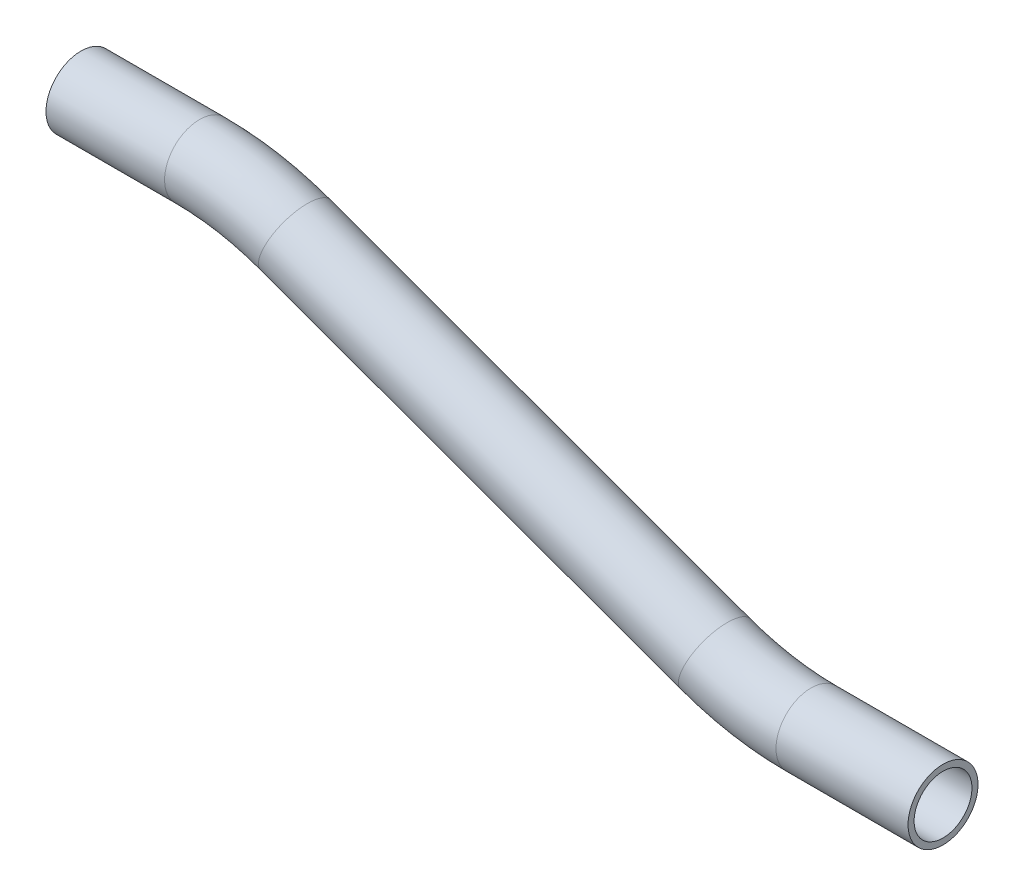
ISO-10303-21;
HEADER;
FILE_DESCRIPTION(('STEP AP214'),'2;1');
FILE_NAME('part.step','',(''),(''),'','','');
FILE_SCHEMA(('AUTOMOTIVE_DESIGN { 1 0 10303 214 1 1 1 1 }'));
ENDSEC;
DATA;
#1=APPLICATION_CONTEXT('core data for automotive mechanical design processes');
#2=APPLICATION_PROTOCOL_DEFINITION('international standard','automotive_design',2000,#1);
#3=PRODUCT_CONTEXT('',#1,'mechanical');
#4=PRODUCT('Part','Part','',(#3));
#5=PRODUCT_RELATED_PRODUCT_CATEGORY('part','',(#4));
#6=PRODUCT_DEFINITION_FORMATION('','',#4);
#7=PRODUCT_DEFINITION_CONTEXT('part definition',#1,'design');
#8=PRODUCT_DEFINITION('design','',#6,#7);
#9=PRODUCT_DEFINITION_SHAPE('','',#8);
#10=(LENGTH_UNIT() NAMED_UNIT(*) SI_UNIT(.MILLI.,.METRE.));
#11=(NAMED_UNIT(*) PLANE_ANGLE_UNIT() SI_UNIT($,.RADIAN.));
#12=(NAMED_UNIT(*) SI_UNIT($,.STERADIAN.) SOLID_ANGLE_UNIT());
#13=UNCERTAINTY_MEASURE_WITH_UNIT(LENGTH_MEASURE(1.E-05),#10,'distance_accuracy_value','');
#14=(GEOMETRIC_REPRESENTATION_CONTEXT(3) GLOBAL_UNCERTAINTY_ASSIGNED_CONTEXT((#13)) GLOBAL_UNIT_ASSIGNED_CONTEXT((#10,
#11,#12)) REPRESENTATION_CONTEXT('',''));
#15=CARTESIAN_POINT('',(0.,0.,0.));
#16=DIRECTION('',(0.,0.,1.));
#17=DIRECTION('',(1.,0.,0.));
#18=AXIS2_PLACEMENT_3D('',#15,#16,#17);
#19=CARTESIAN_POINT('',(29.832195521445,-12.1999675551632,0.));
#20=DIRECTION('',(1.,0.,0.));
#21=DIRECTION('',(0.,1.,0.));
#22=AXIS2_PLACEMENT_3D('',#19,#20,#21);
#23=CYLINDRICAL_SURFACE('',#22,9.525);
#24=CARTESIAN_POINT('',(62.11607959146,-12.1999675551632,0.));
#25=DIRECTION('',(1.,0.,0.));
#26=DIRECTION('',(0.,1.,0.));
#27=AXIS2_PLACEMENT_3D('',#24,#25,#26);
#28=CIRCLE('',#27,9.525);
#29=CARTESIAN_POINT('',(62.11607959146,-2.67496755516321,0.));
#30=VERTEX_POINT('',#29);
#31=EDGE_CURVE('E56',#30,#30,#28,.T.);
#32=ORIENTED_EDGE('',*,*,#31,.F.);
#33=EDGE_LOOP('',(#32));
#34=FACE_BOUND('',#33,.T.);
#35=CARTESIAN_POINT('',(29.832195521445,-12.1999675551632,0.));
#36=DIRECTION('',(1.,0.,0.));
#37=DIRECTION('',(0.,1.,0.));
#38=AXIS2_PLACEMENT_3D('',#35,#36,#37);
#39=CIRCLE('',#38,9.525);
#40=CARTESIAN_POINT('',(29.832195521445,-2.67496755516321,0.));
#41=VERTEX_POINT('',#40);
#42=EDGE_CURVE('E53',#41,#41,#39,.T.);
#43=ORIENTED_EDGE('',*,*,#42,.T.);
#44=EDGE_LOOP('',(#43));
#45=FACE_BOUND('',#44,.T.);
#46=ADVANCED_FACE('F32',(#34,#45),#23,.T.);
#47=CARTESIAN_POINT('',(62.11607959146,-88.3999675551632,0.));
#48=DIRECTION('',(0.,0.,-1.));
#49=DIRECTION('',(-1.,0.,0.));
#50=AXIS2_PLACEMENT_3D('',#47,#48,#49);
#51=TOROIDAL_SURFACE('',#50,76.2,9.525);
#52=CARTESIAN_POINT('',(88.178014512876,-16.795389851277,0.));
#53=DIRECTION('',(0.939692620785908,-0.342020143325669,0.));
#54=DIRECTION('',(0.342020143325669,0.939692620785908,0.));
#55=AXIS2_PLACEMENT_3D('',#52,#53,#54);
#56=CIRCLE('',#55,9.525);
#57=CARTESIAN_POINT('',(91.435756378053,-7.8448176382912,0.));
#58=VERTEX_POINT('',#57);
#59=EDGE_CURVE('E59',#58,#58,#56,.T.);
#60=CARTESIAN_POINT('',(62.11607959146,-88.3999675551632,0.));
#61=DIRECTION('',(0.,0.,-1.));
#62=DIRECTION('',(-1.,0.,0.));
#63=AXIS2_PLACEMENT_3D('',#60,#61,#62);
#64=CIRCLE('',#63,85.725);
#65=EDGE_CURVE('',#30,#58,#64,.T.);
#66=ORIENTED_EDGE('',*,*,#31,.T.);
#67=ORIENTED_EDGE('',*,*,#59,.F.);
#68=ORIENTED_EDGE('',*,*,#65,.T.);
#69=ORIENTED_EDGE('',*,*,#65,.F.);
#70=EDGE_LOOP('',(#66,#68,#67,#69));
#71=FACE_BOUND('',#70,.T.);
#72=ADVANCED_FACE('F78',(#71),#51,.T.);
#73=CARTESIAN_POINT('',(88.178014512876,-16.795389851277,0.));
#74=DIRECTION('',(0.939692620785908,-0.342020143325669,0.));
#75=DIRECTION('',(0.342020143325669,0.939692620785908,0.));
#76=AXIS2_PLACEMENT_3D('',#73,#74,#75);
#77=CYLINDRICAL_SURFACE('',#76,9.525);
#78=CARTESIAN_POINT('',(202.498229430524,-58.4045452562159,0.));
#79=DIRECTION('',(0.939692620785908,-0.342020143325669,0.));
#80=DIRECTION('',(0.342020143325669,0.939692620785908,0.));
#81=AXIS2_PLACEMENT_3D('',#78,#79,#80);
#82=CIRCLE('',#81,9.525);
#83=CARTESIAN_POINT('',(199.240487565347,-67.3551174692017,0.));
#84=VERTEX_POINT('',#83);
#85=EDGE_CURVE('E61',#84,#84,#82,.T.);
#86=ORIENTED_EDGE('',*,*,#85,.F.);
#87=EDGE_LOOP('',(#86));
#88=FACE_BOUND('',#87,.T.);
#89=ORIENTED_EDGE('',*,*,#59,.T.);
#90=EDGE_LOOP('',(#89));
#91=FACE_BOUND('',#90,.T.);
#92=ADVANCED_FACE('F71',(#88,#91),#77,.T.);
#93=CARTESIAN_POINT('',(228.56016435194,13.2000324476703,0.));
#94=DIRECTION('',(0.,0.,1.));
#95=DIRECTION('',(1.,0.,0.));
#96=AXIS2_PLACEMENT_3D('',#93,#94,#95);
#97=TOROIDAL_SURFACE('',#96,76.2,9.525);
#98=CARTESIAN_POINT('',(228.56016435194,-62.9999675523297,0.));
#99=DIRECTION('',(1.,0.,0.));
#100=DIRECTION('',(0.,1.,0.));
#101=AXIS2_PLACEMENT_3D('',#98,#99,#100);
#102=CIRCLE('',#101,9.525);
#103=CARTESIAN_POINT('',(228.56016435194,-72.5249675523297,0.));
#104=VERTEX_POINT('',#103);
#105=EDGE_CURVE('E36',#104,#104,#102,.T.);
#106=CARTESIAN_POINT('',(228.56016435194,13.2000324476703,0.));
#107=DIRECTION('',(0.,0.,1.));
#108=DIRECTION('',(1.,0.,0.));
#109=AXIS2_PLACEMENT_3D('',#106,#107,#108);
#110=CIRCLE('',#109,85.725);
#111=EDGE_CURVE('',#84,#104,#110,.T.);
#112=ORIENTED_EDGE('',*,*,#85,.T.);
#113=ORIENTED_EDGE('',*,*,#105,.F.);
#114=ORIENTED_EDGE('',*,*,#111,.T.);
#115=ORIENTED_EDGE('',*,*,#111,.F.);
#116=EDGE_LOOP('',(#112,#114,#113,#115));
#117=FACE_BOUND('',#116,.T.);
#118=ADVANCED_FACE('F69',(#117),#97,.T.);
#119=CARTESIAN_POINT('',(228.56016435194,-62.9999675523298,0.));
#120=DIRECTION('',(1.,0.,0.));
#121=DIRECTION('',(0.,1.,0.));
#122=AXIS2_PLACEMENT_3D('',#119,#120,#121);
#123=CYLINDRICAL_SURFACE('',#122,9.525);
#124=CARTESIAN_POINT('',(264.501648421955,-62.9999675523297,0.));
#125=DIRECTION('',(1.,0.,0.));
#126=DIRECTION('',(0.,1.,0.));
#127=AXIS2_PLACEMENT_3D('',#124,#125,#126);
#128=CIRCLE('',#127,9.525);
#129=CARTESIAN_POINT('',(264.501648421955,-53.4749675523297,0.));
#130=VERTEX_POINT('',#129);
#131=EDGE_CURVE('E49',#130,#130,#128,.T.);
#132=ORIENTED_EDGE('',*,*,#131,.F.);
#133=EDGE_LOOP('',(#132));
#134=FACE_BOUND('',#133,.T.);
#135=ORIENTED_EDGE('',*,*,#105,.T.);
#136=EDGE_LOOP('',(#135));
#137=FACE_BOUND('',#136,.T.);
#138=ADVANCED_FACE('F34',(#134,#137),#123,.T.);
#139=CARTESIAN_POINT('',(29.832195521445,-12.1999675551632,0.));
#140=DIRECTION('',(1.,0.,0.));
#141=DIRECTION('',(0.,1.,0.));
#142=AXIS2_PLACEMENT_3D('',#139,#140,#141);
#143=PLANE('',#142);
#144=CARTESIAN_POINT('',(29.832195521445,-12.1999675551632,0.));
#145=DIRECTION('',(1.,0.,0.));
#146=DIRECTION('',(0.,1.,0.));
#147=AXIS2_PLACEMENT_3D('',#144,#145,#146);
#148=CIRCLE('',#147,7.874);
#149=CARTESIAN_POINT('',(29.832195521445,-4.32596755516321,0.));
#150=VERTEX_POINT('',#149);
#151=EDGE_CURVE('E52',#150,#150,#148,.F.);
#152=ORIENTED_EDGE('',*,*,#151,.F.);
#153=EDGE_LOOP('',(#152));
#154=FACE_BOUND('',#153,.T.);
#155=ORIENTED_EDGE('',*,*,#42,.F.);
#156=EDGE_LOOP('',(#155));
#157=FACE_BOUND('',#156,.T.);
#158=ADVANCED_FACE('F76',(#154,#157),#143,.F.);
#159=CARTESIAN_POINT('',(264.501648421955,-62.9999675523297,0.));
#160=DIRECTION('',(1.,0.,0.));
#161=DIRECTION('',(0.,1.,0.));
#162=AXIS2_PLACEMENT_3D('',#159,#160,#161);
#163=PLANE('',#162);
#164=CARTESIAN_POINT('',(264.501648421955,-62.9999675523297,0.));
#165=DIRECTION('',(1.,0.,0.));
#166=DIRECTION('',(0.,1.,0.));
#167=AXIS2_PLACEMENT_3D('',#164,#165,#166);
#168=CIRCLE('',#167,7.874);
#169=CARTESIAN_POINT('',(264.501648421955,-55.1259675523297,0.));
#170=VERTEX_POINT('',#169);
#171=EDGE_CURVE('E10',#170,#170,#168,.F.);
#172=ORIENTED_EDGE('',*,*,#171,.T.);
#173=EDGE_LOOP('',(#172));
#174=FACE_BOUND('',#173,.T.);
#175=ORIENTED_EDGE('',*,*,#131,.T.);
#176=EDGE_LOOP('',(#175));
#177=FACE_BOUND('',#176,.T.);
#178=ADVANCED_FACE('F95',(#174,#177),#163,.T.);
#179=CARTESIAN_POINT('',(29.832195521445,-12.1999675551632,0.));
#180=DIRECTION('',(1.,0.,0.));
#181=DIRECTION('',(0.,1.,0.));
#182=AXIS2_PLACEMENT_3D('',#179,#180,#181);
#183=CYLINDRICAL_SURFACE('',#182,7.874);
#184=CARTESIAN_POINT('',(62.11607959146,-12.1999675551632,0.));
#185=DIRECTION('',(1.,0.,0.));
#186=DIRECTION('',(0.,1.,0.));
#187=AXIS2_PLACEMENT_3D('',#184,#185,#186);
#188=CIRCLE('',#187,7.874);
#189=CARTESIAN_POINT('',(62.11607959146,-4.32596755516321,0.));
#190=VERTEX_POINT('',#189);
#191=EDGE_CURVE('E191',#190,#190,#188,.F.);
#192=ORIENTED_EDGE('',*,*,#191,.F.);
#193=EDGE_LOOP('',(#192));
#194=FACE_BOUND('',#193,.T.);
#195=ORIENTED_EDGE('',*,*,#151,.T.);
#196=EDGE_LOOP('',(#195));
#197=FACE_BOUND('',#196,.T.);
#198=ADVANCED_FACE('F98',(#194,#197),#183,.F.);
#199=CARTESIAN_POINT('',(62.11607959146,-88.3999675551632,0.));
#200=DIRECTION('',(0.,0.,-1.));
#201=DIRECTION('',(-1.,0.,0.));
#202=AXIS2_PLACEMENT_3D('',#199,#200,#201);
#203=TOROIDAL_SURFACE('',#202,76.2,7.874);
#204=CARTESIAN_POINT('',(88.178014512876,-16.795389851277,0.));
#205=DIRECTION('',(0.939692620785908,-0.342020143325669,0.));
#206=DIRECTION('',(0.342020143325669,0.939692620785908,0.));
#207=AXIS2_PLACEMENT_3D('',#204,#205,#206);
#208=CIRCLE('',#207,7.874);
#209=CARTESIAN_POINT('',(90.8710811214223,-9.39625015520874,0.));
#210=VERTEX_POINT('',#209);
#211=EDGE_CURVE('E190',#210,#210,#208,.F.);
#212=CARTESIAN_POINT('',(62.11607959146,-88.3999675551632,0.));
#213=DIRECTION('',(0.,0.,-1.));
#214=DIRECTION('',(-1.,0.,0.));
#215=AXIS2_PLACEMENT_3D('',#212,#213,#214);
#216=CIRCLE('',#215,84.074);
#217=EDGE_CURVE('',#190,#210,#216,.T.);
#218=ORIENTED_EDGE('',*,*,#191,.T.);
#219=ORIENTED_EDGE('',*,*,#211,.F.);
#220=ORIENTED_EDGE('',*,*,#217,.T.);
#221=ORIENTED_EDGE('',*,*,#217,.F.);
#222=EDGE_LOOP('',(#218,#220,#219,#221));
#223=FACE_BOUND('',#222,.T.);
#224=ADVANCED_FACE('F153',(#223),#203,.F.);
#225=CARTESIAN_POINT('',(88.178014512876,-16.795389851277,0.));
#226=DIRECTION('',(0.939692620785908,-0.342020143325669,0.));
#227=DIRECTION('',(0.342020143325669,0.939692620785908,0.));
#228=AXIS2_PLACEMENT_3D('',#225,#226,#227);
#229=CYLINDRICAL_SURFACE('',#228,7.874);
#230=CARTESIAN_POINT('',(202.498229430524,-58.4045452562159,0.));
#231=DIRECTION('',(0.939692620785908,-0.342020143325669,0.));
#232=DIRECTION('',(0.342020143325669,0.939692620785908,0.));
#233=AXIS2_PLACEMENT_3D('',#230,#231,#232);
#234=CIRCLE('',#233,7.874);
#235=CARTESIAN_POINT('',(199.805162821977,-65.8036849522842,0.));
#236=VERTEX_POINT('',#235);
#237=EDGE_CURVE('E45',#236,#236,#234,.F.);
#238=ORIENTED_EDGE('',*,*,#237,.F.);
#239=EDGE_LOOP('',(#238));
#240=FACE_BOUND('',#239,.T.);
#241=ORIENTED_EDGE('',*,*,#211,.T.);
#242=EDGE_LOOP('',(#241));
#243=FACE_BOUND('',#242,.T.);
#244=ADVANCED_FACE('F89',(#240,#243),#229,.F.);
#245=CARTESIAN_POINT('',(228.56016435194,13.2000324476703,0.));
#246=DIRECTION('',(0.,0.,1.));
#247=DIRECTION('',(1.,0.,0.));
#248=AXIS2_PLACEMENT_3D('',#245,#246,#247);
#249=TOROIDAL_SURFACE('',#248,76.2,7.874);
#250=CARTESIAN_POINT('',(228.56016435194,-62.9999675523297,0.));
#251=DIRECTION('',(1.,0.,0.));
#252=DIRECTION('',(0.,1.,0.));
#253=AXIS2_PLACEMENT_3D('',#250,#251,#252);
#254=CIRCLE('',#253,7.874);
#255=CARTESIAN_POINT('',(228.56016435194,-70.8739675523297,0.));
#256=VERTEX_POINT('',#255);
#257=EDGE_CURVE('E40',#256,#256,#254,.F.);
#258=CARTESIAN_POINT('',(228.56016435194,13.2000324476703,0.));
#259=DIRECTION('',(0.,0.,1.));
#260=DIRECTION('',(1.,0.,0.));
#261=AXIS2_PLACEMENT_3D('',#258,#259,#260);
#262=CIRCLE('',#261,84.074);
#263=EDGE_CURVE('',#236,#256,#262,.T.);
#264=ORIENTED_EDGE('',*,*,#237,.T.);
#265=ORIENTED_EDGE('',*,*,#257,.F.);
#266=ORIENTED_EDGE('',*,*,#263,.T.);
#267=ORIENTED_EDGE('',*,*,#263,.F.);
#268=EDGE_LOOP('',(#264,#266,#265,#267));
#269=FACE_BOUND('',#268,.T.);
#270=ADVANCED_FACE('F83',(#269),#249,.F.);
#271=CARTESIAN_POINT('',(228.56016435194,-62.9999675523298,0.));
#272=DIRECTION('',(1.,0.,0.));
#273=DIRECTION('',(0.,1.,0.));
#274=AXIS2_PLACEMENT_3D('',#271,#272,#273);
#275=CYLINDRICAL_SURFACE('',#274,7.874);
#276=ORIENTED_EDGE('',*,*,#171,.F.);
#277=EDGE_LOOP('',(#276));
#278=FACE_BOUND('',#277,.T.);
#279=ORIENTED_EDGE('',*,*,#257,.T.);
#280=EDGE_LOOP('',(#279));
#281=FACE_BOUND('',#280,.T.);
#282=ADVANCED_FACE('F81',(#278,#281),#275,.F.);
#283=CLOSED_SHELL('',(#46,#72,#92,#118,#138,#158,#178,#198,#224,#244,#270,#282));
#284=MANIFOLD_SOLID_BREP('B2',#283);
#285=ADVANCED_BREP_SHAPE_REPRESENTATION('',(#18,#284),#14);
#286=SHAPE_DEFINITION_REPRESENTATION(#9,#285);
ENDSEC;
END-ISO-10303-21;
